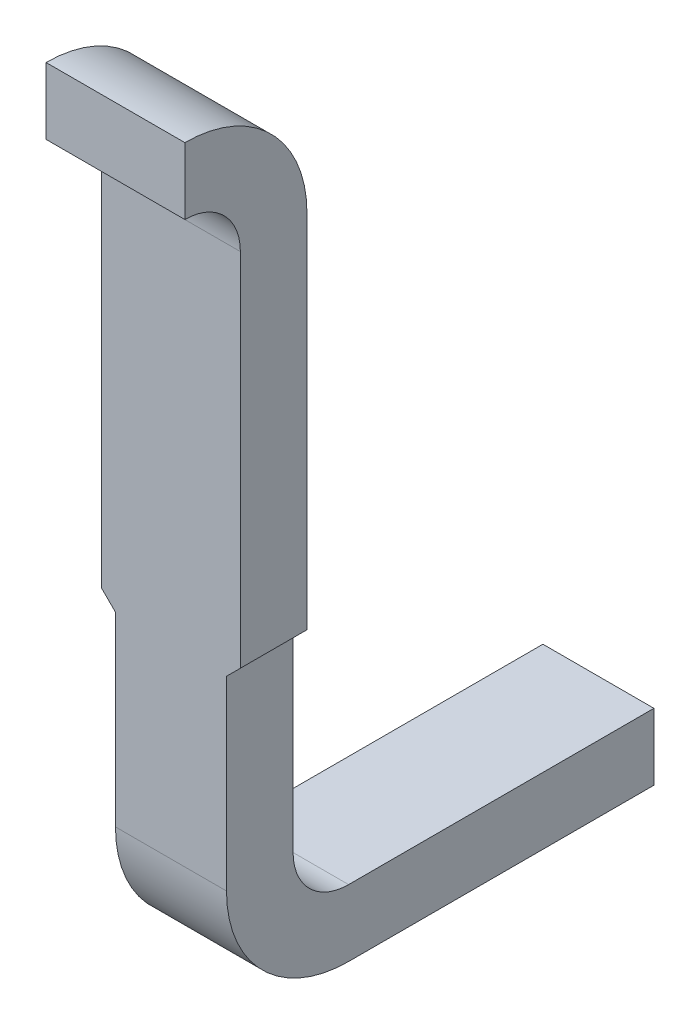
ISO-10303-21;
HEADER;
FILE_DESCRIPTION(('STEP AP214'),'2;1');
FILE_NAME('part.step','',(''),(''),'','','');
FILE_SCHEMA(('AUTOMOTIVE_DESIGN { 1 0 10303 214 1 1 1 1 }'));
ENDSEC;
DATA;
#1=APPLICATION_CONTEXT('core data for automotive mechanical design processes');
#2=APPLICATION_PROTOCOL_DEFINITION('international standard','automotive_design',2000,#1);
#3=PRODUCT_CONTEXT('',#1,'mechanical');
#4=PRODUCT('Part','Part','',(#3));
#5=PRODUCT_RELATED_PRODUCT_CATEGORY('part','',(#4));
#6=PRODUCT_DEFINITION_FORMATION('','',#4);
#7=PRODUCT_DEFINITION_CONTEXT('part definition',#1,'design');
#8=PRODUCT_DEFINITION('design','',#6,#7);
#9=PRODUCT_DEFINITION_SHAPE('','',#8);
#10=(LENGTH_UNIT() NAMED_UNIT(*) SI_UNIT(.MILLI.,.METRE.));
#11=(NAMED_UNIT(*) PLANE_ANGLE_UNIT() SI_UNIT($,.RADIAN.));
#12=(NAMED_UNIT(*) SI_UNIT($,.STERADIAN.) SOLID_ANGLE_UNIT());
#13=UNCERTAINTY_MEASURE_WITH_UNIT(LENGTH_MEASURE(1.E-05),#10,'distance_accuracy_value','');
#14=(GEOMETRIC_REPRESENTATION_CONTEXT(3) GLOBAL_UNCERTAINTY_ASSIGNED_CONTEXT((#13)) GLOBAL_UNIT_ASSIGNED_CONTEXT((#10,
#11,#12)) REPRESENTATION_CONTEXT('',''));
#15=CARTESIAN_POINT('',(0.,0.,0.));
#16=DIRECTION('',(0.,0.,1.));
#17=DIRECTION('',(1.,0.,0.));
#18=AXIS2_PLACEMENT_3D('',#15,#16,#17);
#19=CARTESIAN_POINT('',(17.46210819787,11.48941215274,-11.17169883308));
#20=DIRECTION('',(0.,0.,-1.));
#21=DIRECTION('',(-1.,0.,0.));
#22=AXIS2_PLACEMENT_3D('',#19,#20,#21);
#23=PLANE('',#22);
#24=DIRECTION('',(0.,1.,0.));
#25=VECTOR('',#24,1.);
#26=CARTESIAN_POINT('',(17.91210814532,5.079903349409,-11.17169883308));
#27=LINE('',#26,#25);
#28=CARTESIAN_POINT('',(17.91210814532,12.81951558355,-11.17169883308));
#29=VERTEX_POINT('',#28);
#30=CARTESIAN_POINT('',(17.91210814532,12.93951558355,-11.17169883308));
#31=VERTEX_POINT('',#30);
#32=EDGE_CURVE('E11',#29,#31,#27,.T.);
#33=ORIENTED_EDGE('',*,*,#32,.T.);
#34=DIRECTION('',(-1.,0.,0.));
#35=VECTOR('',#34,1.);
#36=CARTESIAN_POINT('',(13.11210817501,12.93951558355,-11.17169883308));
#37=LINE('',#36,#35);
#38=CARTESIAN_POINT('',(17.66210814532,12.93951558355,-11.17169883308));
#39=VERTEX_POINT('',#38);
#40=EDGE_CURVE('E21',#31,#39,#37,.T.);
#41=ORIENTED_EDGE('',*,*,#40,.T.);
#42=DIRECTION('',(0.,-1.,0.));
#43=VECTOR('',#42,1.);
#44=CARTESIAN_POINT('',(17.66210814532,5.079903349409,-11.17169883308));
#45=LINE('',#44,#43);
#46=CARTESIAN_POINT('',(17.66210814532,12.81951558355,-11.17169883308));
#47=VERTEX_POINT('',#46);
#48=EDGE_CURVE('E263',#39,#47,#45,.T.);
#49=ORIENTED_EDGE('',*,*,#48,.T.);
#50=DIRECTION('',(1.,0.,0.));
#51=VECTOR('',#50,1.);
#52=CARTESIAN_POINT('',(0.,12.81951558355,-11.17169883308));
#53=LINE('',#52,#51);
#54=EDGE_CURVE('E276',#47,#29,#53,.T.);
#55=ORIENTED_EDGE('',*,*,#54,.T.);
#56=EDGE_LOOP('',(#33,#41,#49,#55));
#57=FACE_BOUND('',#56,.T.);
#58=ADVANCED_FACE('F17',(#57),#23,.F.);
#59=CARTESIAN_POINT('',(17.91210814532,12.93951558355,-11.91169883308));
#60=DIRECTION('',(1.,0.,0.));
#61=DIRECTION('',(0.,0.,-1.));
#62=AXIS2_PLACEMENT_3D('',#59,#60,#61);
#63=PLANE('',#62);
#64=CARTESIAN_POINT('',(17.91210814532,12.71951558355,-11.17169883308));
#65=DIRECTION('',(-1.,0.,0.));
#66=DIRECTION('',(0.,0.,1.));
#67=AXIS2_PLACEMENT_3D('',#64,#65,#66);
#68=CIRCLE('',#67,0.22);
#69=CARTESIAN_POINT('',(17.91210814532,12.71951558355,-11.39169883308));
#70=VERTEX_POINT('',#69);
#71=EDGE_CURVE('E28',#31,#70,#68,.T.);
#72=ORIENTED_EDGE('',*,*,#71,.F.);
#73=ORIENTED_EDGE('',*,*,#32,.F.);
#74=CARTESIAN_POINT('',(17.91210814532,12.71951558355,-11.17169883308));
#75=DIRECTION('',(-1.,0.,0.));
#76=DIRECTION('',(0.,0.,-1.));
#77=AXIS2_PLACEMENT_3D('',#74,#75,#76);
#78=CIRCLE('',#77,0.1);
#79=CARTESIAN_POINT('',(17.91210814532,12.71951558355,-11.27169883308));
#80=VERTEX_POINT('',#79);
#81=EDGE_CURVE('E260',#29,#80,#78,.T.);
#82=ORIENTED_EDGE('',*,*,#81,.T.);
#83=DIRECTION('',(0.,-1.,0.));
#84=VECTOR('',#83,1.);
#85=CARTESIAN_POINT('',(17.91210814532,12.93951558355,-11.27169883308));
#86=LINE('',#85,#84);
#87=CARTESIAN_POINT('',(17.91210814532,12.06951558355,-11.27169883308));
#88=VERTEX_POINT('',#87);
#89=EDGE_CURVE('E222',#80,#88,#86,.T.);
#90=ORIENTED_EDGE('',*,*,#89,.T.);
#91=DIRECTION('',(0.,0.,-1.));
#92=VECTOR('',#91,1.);
#93=CARTESIAN_POINT('',(17.91210814532,12.06951558355,-11.91169883308));
#94=LINE('',#93,#92);
#95=CARTESIAN_POINT('',(17.91210814532,12.06951558355,-11.39169883308));
#96=VERTEX_POINT('',#95);
#97=EDGE_CURVE('E217',#88,#96,#94,.T.);
#98=ORIENTED_EDGE('',*,*,#97,.T.);
#99=DIRECTION('',(0.,1.,0.));
#100=VECTOR('',#99,1.);
#101=CARTESIAN_POINT('',(17.91210814532,12.93951558355,-11.39169883308));
#102=LINE('',#101,#100);
#103=EDGE_CURVE('E241',#96,#70,#102,.T.);
#104=ORIENTED_EDGE('',*,*,#103,.T.);
#105=EDGE_LOOP('',(#72,#73,#82,#90,#98,#104));
#106=FACE_BOUND('',#105,.T.);
#107=ADVANCED_FACE('F441',(#106),#63,.T.);
#108=CARTESIAN_POINT('',(12.81210814532,12.71951558355,-11.17169883308));
#109=DIRECTION('',(1.,0.,0.));
#110=DIRECTION('',(0.,0.,1.));
#111=AXIS2_PLACEMENT_3D('',#108,#109,#110);
#112=CYLINDRICAL_SURFACE('',#111,0.22);
#113=ORIENTED_EDGE('',*,*,#40,.F.);
#114=ORIENTED_EDGE('',*,*,#71,.T.);
#115=DIRECTION('',(-1.,0.,0.));
#116=VECTOR('',#115,1.);
#117=CARTESIAN_POINT('',(12.81210814532,12.71951558355,-11.39169883308));
#118=LINE('',#117,#116);
#119=CARTESIAN_POINT('',(17.66210814532,12.71951558355,-11.39169883308));
#120=VERTEX_POINT('',#119);
#121=EDGE_CURVE('E218',#70,#120,#118,.T.);
#122=ORIENTED_EDGE('',*,*,#121,.T.);
#123=CARTESIAN_POINT('',(17.66210814532,12.71951558355,-11.17169883308));
#124=DIRECTION('',(-1.,0.,0.));
#125=DIRECTION('',(0.,0.,1.));
#126=AXIS2_PLACEMENT_3D('',#123,#124,#125);
#127=CIRCLE('',#126,0.22);
#128=EDGE_CURVE('E261',#39,#120,#127,.T.);
#129=ORIENTED_EDGE('',*,*,#128,.F.);
#130=EDGE_LOOP('',(#113,#114,#122,#129));
#131=FACE_BOUND('',#130,.T.);
#132=ADVANCED_FACE('F19',(#131),#112,.T.);
#133=CARTESIAN_POINT('',(17.66210814532,12.93951558355,-10.75169883308));
#134=DIRECTION('',(-1.,0.,0.));
#135=DIRECTION('',(0.,1.,0.));
#136=AXIS2_PLACEMENT_3D('',#133,#134,#135);
#137=PLANE('',#136);
#138=CARTESIAN_POINT('',(17.66210814532,12.71951558355,-11.17169883308));
#139=DIRECTION('',(1.,0.,0.));
#140=DIRECTION('',(0.,0.,-1.));
#141=AXIS2_PLACEMENT_3D('',#138,#139,#140);
#142=CIRCLE('',#141,0.1);
#143=CARTESIAN_POINT('',(17.66210814532,12.71951558355,-11.27169883308));
#144=VERTEX_POINT('',#143);
#145=EDGE_CURVE('E256',#144,#47,#142,.T.);
#146=ORIENTED_EDGE('',*,*,#145,.T.);
#147=ORIENTED_EDGE('',*,*,#48,.F.);
#148=ORIENTED_EDGE('',*,*,#128,.T.);
#149=DIRECTION('',(0.,-1.,0.));
#150=VECTOR('',#149,1.);
#151=CARTESIAN_POINT('',(17.66210814532,12.93951558355,-11.39169883308));
#152=LINE('',#151,#150);
#153=CARTESIAN_POINT('',(17.66210814532,12.06951558355,-11.39169883308));
#154=VERTEX_POINT('',#153);
#155=EDGE_CURVE('E140',#120,#154,#152,.T.);
#156=ORIENTED_EDGE('',*,*,#155,.T.);
#157=DIRECTION('',(0.,0.,1.));
#158=VECTOR('',#157,1.);
#159=CARTESIAN_POINT('',(17.66210814532,12.06951558355,-10.75169883308));
#160=LINE('',#159,#158);
#161=CARTESIAN_POINT('',(17.66210814532,12.06951558355,-11.27169883308));
#162=VERTEX_POINT('',#161);
#163=EDGE_CURVE('E247',#154,#162,#160,.T.);
#164=ORIENTED_EDGE('',*,*,#163,.T.);
#165=DIRECTION('',(0.,1.,0.));
#166=VECTOR('',#165,1.);
#167=CARTESIAN_POINT('',(17.66210814532,12.93951558355,-11.27169883308));
#168=LINE('',#167,#166);
#169=EDGE_CURVE('E131',#162,#144,#168,.T.);
#170=ORIENTED_EDGE('',*,*,#169,.T.);
#171=EDGE_LOOP('',(#146,#147,#148,#156,#164,#170));
#172=FACE_BOUND('',#171,.T.);
#173=ADVANCED_FACE('F480',(#172),#137,.T.);
#174=CARTESIAN_POINT('',(19.01210814532,12.71951558355,-11.17169883308));
#175=DIRECTION('',(-1.,0.,0.));
#176=DIRECTION('',(0.,0.,-1.));
#177=AXIS2_PLACEMENT_3D('',#174,#175,#176);
#178=CYLINDRICAL_SURFACE('',#177,0.1);
#179=ORIENTED_EDGE('',*,*,#145,.F.);
#180=DIRECTION('',(-1.,0.,0.));
#181=VECTOR('',#180,1.);
#182=CARTESIAN_POINT('',(19.01210814532,12.71951558355,-11.27169883308));
#183=LINE('',#182,#181);
#184=EDGE_CURVE('E229',#80,#144,#183,.T.);
#185=ORIENTED_EDGE('',*,*,#184,.F.);
#186=ORIENTED_EDGE('',*,*,#81,.F.);
#187=ORIENTED_EDGE('',*,*,#54,.F.);
#188=EDGE_LOOP('',(#179,#185,#186,#187));
#189=FACE_BOUND('',#188,.T.);
#190=ADVANCED_FACE('F479',(#189),#178,.F.);
#191=CARTESIAN_POINT('',(17.66210814532,11.48951558355,-11.27169883308));
#192=DIRECTION('',(0.,0.,1.));
#193=DIRECTION('',(1.,0.,0.));
#194=AXIS2_PLACEMENT_3D('',#191,#192,#193);
#195=PLANE('',#194);
#196=DIRECTION('',(0.,1.,0.));
#197=VECTOR('',#196,1.);
#198=CARTESIAN_POINT('',(17.88710814532,11.48951558355,-11.27169883308));
#199=LINE('',#198,#197);
#200=CARTESIAN_POINT('',(17.88710814532,11.70951558355,-11.27169883308));
#201=VERTEX_POINT('',#200);
#202=CARTESIAN_POINT('',(17.88710814532,12.04451558355,-11.27169883308));
#203=VERTEX_POINT('',#202);
#204=EDGE_CURVE('E212',#201,#203,#199,.T.);
#205=ORIENTED_EDGE('',*,*,#204,.T.);
#206=DIRECTION('',(0.707106781187048,0.707106781186048,0.));
#207=VECTOR('',#206,1.);
#208=CARTESIAN_POINT('',(17.88710814532,12.04451558355,-11.27169883308));
#209=LINE('',#208,#207);
#210=EDGE_CURVE('E206',#203,#88,#209,.T.);
#211=ORIENTED_EDGE('',*,*,#210,.T.);
#212=ORIENTED_EDGE('',*,*,#89,.F.);
#213=ORIENTED_EDGE('',*,*,#184,.T.);
#214=ORIENTED_EDGE('',*,*,#169,.F.);
#215=DIRECTION('',(0.707106781186048,-0.707106781187048,0.));
#216=VECTOR('',#215,1.);
#217=CARTESIAN_POINT('',(17.66210814532,12.06951558355,-11.27169883308));
#218=LINE('',#217,#216);
#219=CARTESIAN_POINT('',(17.68710814532,12.04451558355,-11.27169883308));
#220=VERTEX_POINT('',#219);
#221=EDGE_CURVE('E238',#162,#220,#218,.T.);
#222=ORIENTED_EDGE('',*,*,#221,.T.);
#223=DIRECTION('',(0.,-1.,0.));
#224=VECTOR('',#223,1.);
#225=CARTESIAN_POINT('',(17.68710814532,11.48951558355,-11.27169883308));
#226=LINE('',#225,#224);
#227=CARTESIAN_POINT('',(17.68710814532,11.70951558355,-11.27169883308));
#228=VERTEX_POINT('',#227);
#229=EDGE_CURVE('E81',#220,#228,#226,.T.);
#230=ORIENTED_EDGE('',*,*,#229,.T.);
#231=DIRECTION('',(1.,0.,0.));
#232=VECTOR('',#231,1.);
#233=CARTESIAN_POINT('',(17.66210814532,11.70951558355,-11.27169883308));
#234=LINE('',#233,#232);
#235=EDGE_CURVE('E227',#228,#201,#234,.T.);
#236=ORIENTED_EDGE('',*,*,#235,.T.);
#237=EDGE_LOOP('',(#205,#211,#212,#213,#214,#222,#230,#236));
#238=FACE_BOUND('',#237,.T.);
#239=ADVANCED_FACE('F464',(#238),#195,.T.);
#240=CARTESIAN_POINT('',(12.81210814532,12.93951558355,-11.39169883308));
#241=DIRECTION('',(0.,0.,1.));
#242=DIRECTION('',(1.,0.,0.));
#243=AXIS2_PLACEMENT_3D('',#240,#241,#242);
#244=PLANE('',#243);
#245=ORIENTED_EDGE('',*,*,#103,.F.);
#246=DIRECTION('',(0.707106781187048,0.707106781186048,0.));
#247=VECTOR('',#246,1.);
#248=CARTESIAN_POINT('',(17.88710814532,12.04451558355,-11.39169883308));
#249=LINE('',#248,#247);
#250=CARTESIAN_POINT('',(17.88710814532,12.04451558355,-11.39169883308));
#251=VERTEX_POINT('',#250);
#252=EDGE_CURVE('E213',#251,#96,#249,.T.);
#253=ORIENTED_EDGE('',*,*,#252,.F.);
#254=DIRECTION('',(0.,1.,0.));
#255=VECTOR('',#254,1.);
#256=CARTESIAN_POINT('',(17.88710814532,12.93951558355,-11.39169883308));
#257=LINE('',#256,#255);
#258=CARTESIAN_POINT('',(17.88710814532,11.70951558355,-11.39169883308));
#259=VERTEX_POINT('',#258);
#260=EDGE_CURVE('E93',#259,#251,#257,.T.);
#261=ORIENTED_EDGE('',*,*,#260,.F.);
#262=DIRECTION('',(1.,0.,0.));
#263=VECTOR('',#262,1.);
#264=CARTESIAN_POINT('',(12.81210814532,11.70951558355,-11.39169883308));
#265=LINE('',#264,#263);
#266=CARTESIAN_POINT('',(17.68710814532,11.70951558355,-11.39169883308));
#267=VERTEX_POINT('',#266);
#268=EDGE_CURVE('E285',#267,#259,#265,.T.);
#269=ORIENTED_EDGE('',*,*,#268,.F.);
#270=DIRECTION('',(0.,-1.,0.));
#271=VECTOR('',#270,1.);
#272=CARTESIAN_POINT('',(17.68710814532,12.93951558355,-11.39169883308));
#273=LINE('',#272,#271);
#274=CARTESIAN_POINT('',(17.68710814532,12.04451558355,-11.39169883308));
#275=VERTEX_POINT('',#274);
#276=EDGE_CURVE('E249',#275,#267,#273,.T.);
#277=ORIENTED_EDGE('',*,*,#276,.F.);
#278=DIRECTION('',(0.707106781186048,-0.707106781187048,0.));
#279=VECTOR('',#278,1.);
#280=CARTESIAN_POINT('',(17.66210814532,12.06951558355,-11.39169883308));
#281=LINE('',#280,#279);
#282=EDGE_CURVE('E242',#154,#275,#281,.T.);
#283=ORIENTED_EDGE('',*,*,#282,.F.);
#284=ORIENTED_EDGE('',*,*,#155,.F.);
#285=ORIENTED_EDGE('',*,*,#121,.F.);
#286=EDGE_LOOP('',(#245,#253,#261,#269,#277,#283,#284,#285));
#287=FACE_BOUND('',#286,.T.);
#288=ADVANCED_FACE('F450',(#287),#244,.F.);
#289=CARTESIAN_POINT('',(17.66210814532,12.06951558355,-10.75169883308));
#290=DIRECTION('',(-0.707106781187048,-0.707106781186048,0.));
#291=DIRECTION('',(-0.707106781186048,0.707106781187048,0.));
#292=AXIS2_PLACEMENT_3D('',#289,#290,#291);
#293=PLANE('',#292);
#294=ORIENTED_EDGE('',*,*,#163,.F.);
#295=ORIENTED_EDGE('',*,*,#282,.T.);
#296=DIRECTION('',(0.,0.,1.));
#297=VECTOR('',#296,1.);
#298=CARTESIAN_POINT('',(17.68710814532,12.04451558355,-10.75169883308));
#299=LINE('',#298,#297);
#300=EDGE_CURVE('E251',#275,#220,#299,.T.);
#301=ORIENTED_EDGE('',*,*,#300,.T.);
#302=ORIENTED_EDGE('',*,*,#221,.F.);
#303=EDGE_LOOP('',(#294,#295,#301,#302));
#304=FACE_BOUND('',#303,.T.);
#305=ADVANCED_FACE('F435',(#304),#293,.T.);
#306=CARTESIAN_POINT('',(17.88210814532,12.03951558355,-8.041698833076));
#307=DIRECTION('',(-0.707106781186048,0.707106781187048,0.));
#308=DIRECTION('',(0.,0.,1.));
#309=AXIS2_PLACEMENT_3D('',#306,#307,#308);
#310=PLANE('',#309);
#311=ORIENTED_EDGE('',*,*,#252,.T.);
#312=ORIENTED_EDGE('',*,*,#97,.F.);
#313=ORIENTED_EDGE('',*,*,#210,.F.);
#314=DIRECTION('',(0.,0.,1.));
#315=VECTOR('',#314,1.);
#316=CARTESIAN_POINT('',(17.88710814532,12.04451558355,-8.041698833076));
#317=LINE('',#316,#315);
#318=EDGE_CURVE('E208',#251,#203,#317,.T.);
#319=ORIENTED_EDGE('',*,*,#318,.F.);
#320=EDGE_LOOP('',(#311,#312,#313,#319));
#321=FACE_BOUND('',#320,.T.);
#322=ADVANCED_FACE('F425',(#321),#310,.F.);
#323=CARTESIAN_POINT('',(17.88710814532,12.03951558355,-11.27169883308));
#324=DIRECTION('',(-1.,0.,0.));
#325=DIRECTION('',(0.,1.,0.));
#326=AXIS2_PLACEMENT_3D('',#323,#324,#325);
#327=PLANE('',#326);
#328=DIRECTION('',(0.,0.,-1.));
#329=VECTOR('',#328,1.);
#330=CARTESIAN_POINT('',(17.88710814532,11.60951558355,-11.27169883308));
#331=LINE('',#330,#329);
#332=CARTESIAN_POINT('',(17.88710814532,11.60951558355,-11.49169883308));
#333=VERTEX_POINT('',#332);
#334=CARTESIAN_POINT('',(17.88710814532,11.60951558355,-12.04169883308));
#335=VERTEX_POINT('',#334);
#336=EDGE_CURVE('E269',#333,#335,#331,.T.);
#337=ORIENTED_EDGE('',*,*,#336,.F.);
#338=CARTESIAN_POINT('',(17.88710814532,11.70951558355,-11.49169883308));
#339=DIRECTION('',(1.,0.,0.));
#340=DIRECTION('',(0.,0.,1.));
#341=AXIS2_PLACEMENT_3D('',#338,#339,#340);
#342=CIRCLE('',#341,0.1);
#343=EDGE_CURVE('E228',#259,#333,#342,.T.);
#344=ORIENTED_EDGE('',*,*,#343,.F.);
#345=ORIENTED_EDGE('',*,*,#260,.T.);
#346=ORIENTED_EDGE('',*,*,#318,.T.);
#347=ORIENTED_EDGE('',*,*,#204,.F.);
#348=CARTESIAN_POINT('',(17.88710814532,11.70951558355,-11.49169883308));
#349=DIRECTION('',(-1.,0.,0.));
#350=DIRECTION('',(0.,0.,-1.));
#351=AXIS2_PLACEMENT_3D('',#348,#349,#350);
#352=CIRCLE('',#351,0.22);
#353=CARTESIAN_POINT('',(17.88710814532,11.48951558355,-11.49169883308));
#354=VERTEX_POINT('',#353);
#355=EDGE_CURVE('E235',#354,#201,#352,.T.);
#356=ORIENTED_EDGE('',*,*,#355,.F.);
#357=DIRECTION('',(0.,0.,1.));
#358=VECTOR('',#357,1.);
#359=CARTESIAN_POINT('',(17.88710814532,11.48951558355,-11.27169883308));
#360=LINE('',#359,#358);
#361=CARTESIAN_POINT('',(17.88710814532,11.48951558355,-12.04169883308));
#362=VERTEX_POINT('',#361);
#363=EDGE_CURVE('E167',#362,#354,#360,.T.);
#364=ORIENTED_EDGE('',*,*,#363,.F.);
#365=DIRECTION('',(0.,-1.,0.));
#366=VECTOR('',#365,1.);
#367=CARTESIAN_POINT('',(17.88710814532,12.03951558355,-12.04169883308));
#368=LINE('',#367,#366);
#369=EDGE_CURVE('E185',#335,#362,#368,.T.);
#370=ORIENTED_EDGE('',*,*,#369,.F.);
#371=EDGE_LOOP('',(#337,#344,#345,#346,#347,#356,#364,#370));
#372=FACE_BOUND('',#371,.T.);
#373=ADVANCED_FACE('F423',(#372),#327,.F.);
#374=CARTESIAN_POINT('',(17.68710814532,12.03951558355,-11.27169883308));
#375=DIRECTION('',(1.,0.,0.));
#376=DIRECTION('',(0.,0.,-1.));
#377=AXIS2_PLACEMENT_3D('',#374,#375,#376);
#378=PLANE('',#377);
#379=DIRECTION('',(0.,0.,-1.));
#380=VECTOR('',#379,1.);
#381=CARTESIAN_POINT('',(17.68710814532,11.48951558355,-11.27169883308));
#382=LINE('',#381,#380);
#383=CARTESIAN_POINT('',(17.68710814532,11.48951558355,-11.49169883308));
#384=VERTEX_POINT('',#383);
#385=CARTESIAN_POINT('',(17.68710814532,11.48951558355,-12.04169883308));
#386=VERTEX_POINT('',#385);
#387=EDGE_CURVE('E176',#384,#386,#382,.T.);
#388=ORIENTED_EDGE('',*,*,#387,.F.);
#389=CARTESIAN_POINT('',(17.68710814532,11.70951558355,-11.49169883308));
#390=DIRECTION('',(1.,0.,0.));
#391=DIRECTION('',(0.,0.,-1.));
#392=AXIS2_PLACEMENT_3D('',#389,#390,#391);
#393=CIRCLE('',#392,0.22);
#394=EDGE_CURVE('E232',#228,#384,#393,.T.);
#395=ORIENTED_EDGE('',*,*,#394,.F.);
#396=ORIENTED_EDGE('',*,*,#229,.F.);
#397=ORIENTED_EDGE('',*,*,#300,.F.);
#398=ORIENTED_EDGE('',*,*,#276,.T.);
#399=CARTESIAN_POINT('',(17.68710814532,11.70951558355,-11.49169883308));
#400=DIRECTION('',(-1.,0.,0.));
#401=DIRECTION('',(0.,0.,1.));
#402=AXIS2_PLACEMENT_3D('',#399,#400,#401);
#403=CIRCLE('',#402,0.1);
#404=CARTESIAN_POINT('',(17.68710814532,11.60951558355,-11.49169883308));
#405=VERTEX_POINT('',#404);
#406=EDGE_CURVE('E223',#405,#267,#403,.T.);
#407=ORIENTED_EDGE('',*,*,#406,.F.);
#408=DIRECTION('',(0.,0.,1.));
#409=VECTOR('',#408,1.);
#410=CARTESIAN_POINT('',(17.68710814532,11.60951558355,-11.27169883308));
#411=LINE('',#410,#409);
#412=CARTESIAN_POINT('',(17.68710814532,11.60951558355,-12.04169883308));
#413=VERTEX_POINT('',#412);
#414=EDGE_CURVE('E191',#413,#405,#411,.T.);
#415=ORIENTED_EDGE('',*,*,#414,.F.);
#416=DIRECTION('',(0.,1.,0.));
#417=VECTOR('',#416,1.);
#418=CARTESIAN_POINT('',(17.68710814532,12.03951558355,-12.04169883308));
#419=LINE('',#418,#417);
#420=EDGE_CURVE('E188',#386,#413,#419,.T.);
#421=ORIENTED_EDGE('',*,*,#420,.F.);
#422=EDGE_LOOP('',(#388,#395,#396,#397,#398,#407,#415,#421));
#423=FACE_BOUND('',#422,.T.);
#424=ADVANCED_FACE('F189',(#423),#378,.F.);
#425=CARTESIAN_POINT('',(17.66210814532,11.70951558355,-11.49169883308));
#426=DIRECTION('',(-1.,0.,0.));
#427=DIRECTION('',(0.,0.,-1.));
#428=AXIS2_PLACEMENT_3D('',#425,#426,#427);
#429=CYLINDRICAL_SURFACE('',#428,0.22);
#430=ORIENTED_EDGE('',*,*,#235,.F.);
#431=ORIENTED_EDGE('',*,*,#394,.T.);
#432=DIRECTION('',(1.,0.,0.));
#433=VECTOR('',#432,1.);
#434=CARTESIAN_POINT('',(17.66210814532,11.48951558355,-11.49169883308));
#435=LINE('',#434,#433);
#436=EDGE_CURVE('E182',#384,#354,#435,.T.);
#437=ORIENTED_EDGE('',*,*,#436,.T.);
#438=ORIENTED_EDGE('',*,*,#355,.T.);
#439=EDGE_LOOP('',(#430,#431,#437,#438));
#440=FACE_BOUND('',#439,.T.);
#441=ADVANCED_FACE('F433',(#440),#429,.T.);
#442=CARTESIAN_POINT('',(12.81210814532,11.70951558355,-11.49169883308));
#443=DIRECTION('',(1.,0.,0.));
#444=DIRECTION('',(0.,0.,1.));
#445=AXIS2_PLACEMENT_3D('',#442,#443,#444);
#446=CYLINDRICAL_SURFACE('',#445,0.1);
#447=ORIENTED_EDGE('',*,*,#268,.T.);
#448=ORIENTED_EDGE('',*,*,#343,.T.);
#449=DIRECTION('',(1.,0.,0.));
#450=VECTOR('',#449,1.);
#451=CARTESIAN_POINT('',(12.81210814532,11.60951558355,-11.49169883308));
#452=LINE('',#451,#450);
#453=EDGE_CURVE('E265',#405,#333,#452,.T.);
#454=ORIENTED_EDGE('',*,*,#453,.F.);
#455=ORIENTED_EDGE('',*,*,#406,.T.);
#456=EDGE_LOOP('',(#447,#448,#454,#455));
#457=FACE_BOUND('',#456,.T.);
#458=ADVANCED_FACE('F455',(#457),#446,.F.);
#459=CARTESIAN_POINT('',(12.81210814532,11.60951558355,-11.91169883308));
#460=DIRECTION('',(0.,-1.,0.));
#461=DIRECTION('',(0.,0.,-1.));
#462=AXIS2_PLACEMENT_3D('',#459,#460,#461);
#463=PLANE('',#462);
#464=ORIENTED_EDGE('',*,*,#414,.T.);
#465=ORIENTED_EDGE('',*,*,#453,.T.);
#466=ORIENTED_EDGE('',*,*,#336,.T.);
#467=DIRECTION('',(-1.,0.,0.));
#468=VECTOR('',#467,1.);
#469=CARTESIAN_POINT('',(12.02567879084,11.60951558355,-12.04169883308));
#470=LINE('',#469,#468);
#471=EDGE_CURVE('E196',#335,#413,#470,.T.);
#472=ORIENTED_EDGE('',*,*,#471,.T.);
#473=EDGE_LOOP('',(#464,#465,#466,#472));
#474=FACE_BOUND('',#473,.T.);
#475=ADVANCED_FACE('F420',(#474),#463,.F.);
#476=CARTESIAN_POINT('',(18.61210814532,11.48951558355,-8.041698833076));
#477=DIRECTION('',(0.,-1.,0.));
#478=DIRECTION('',(0.,0.,-1.));
#479=AXIS2_PLACEMENT_3D('',#476,#477,#478);
#480=PLANE('',#479);
#481=ORIENTED_EDGE('',*,*,#387,.T.);
#482=DIRECTION('',(1.,0.,0.));
#483=VECTOR('',#482,1.);
#484=CARTESIAN_POINT('',(12.02567879084,11.48951558355,-12.04169883308));
#485=LINE('',#484,#483);
#486=EDGE_CURVE('E180',#386,#362,#485,.T.);
#487=ORIENTED_EDGE('',*,*,#486,.T.);
#488=ORIENTED_EDGE('',*,*,#363,.T.);
#489=ORIENTED_EDGE('',*,*,#436,.F.);
#490=EDGE_LOOP('',(#481,#487,#488,#489));
#491=FACE_BOUND('',#490,.T.);
#492=ADVANCED_FACE('F178',(#491),#480,.T.);
#493=CARTESIAN_POINT('',(12.02567879084,1.609515583551,-12.04169883308));
#494=DIRECTION('',(0.,0.,1.));
#495=DIRECTION('',(1.,0.,0.));
#496=AXIS2_PLACEMENT_3D('',#493,#494,#495);
#497=PLANE('',#496);
#498=ORIENTED_EDGE('',*,*,#486,.F.);
#499=ORIENTED_EDGE('',*,*,#420,.T.);
#500=ORIENTED_EDGE('',*,*,#471,.F.);
#501=ORIENTED_EDGE('',*,*,#369,.T.);
#502=EDGE_LOOP('',(#498,#499,#500,#501));
#503=FACE_BOUND('',#502,.T.);
#504=ADVANCED_FACE('F198',(#503),#497,.F.);
#505=CLOSED_SHELL('',(#58,#107,#132,#173,#190,#239,#288,#305,#322,#373,#424,#441,#458,#475,#492,#504));
#506=MANIFOLD_SOLID_BREP('B1',#505);
#507=ADVANCED_BREP_SHAPE_REPRESENTATION('',(#18,#506),#14);
#508=SHAPE_DEFINITION_REPRESENTATION(#9,#507);
ENDSEC;
END-ISO-10303-21;
